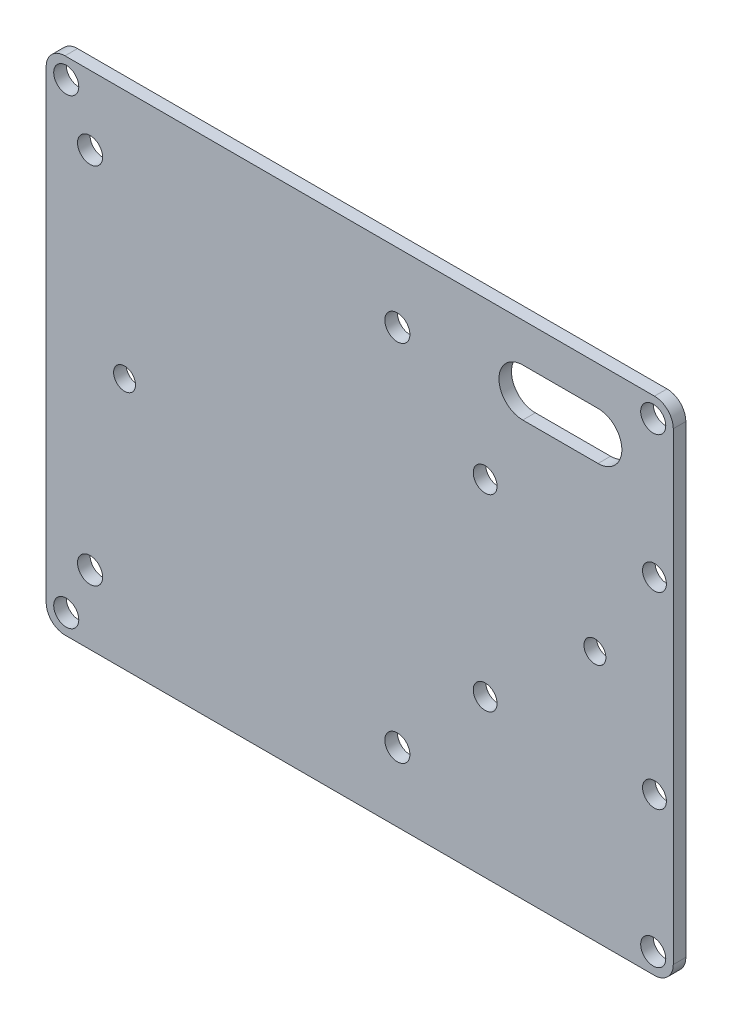
ISO-10303-21;
HEADER;
FILE_DESCRIPTION(('STEP AP214'),'2;1');
FILE_NAME('part.step','',(''),(''),'','','');
FILE_SCHEMA(('AUTOMOTIVE_DESIGN { 1 0 10303 214 1 1 1 1 }'));
ENDSEC;
DATA;
#1=APPLICATION_CONTEXT('core data for automotive mechanical design processes');
#2=APPLICATION_PROTOCOL_DEFINITION('international standard','automotive_design',2000,#1);
#3=PRODUCT_CONTEXT('',#1,'mechanical');
#4=PRODUCT('Part','Part','',(#3));
#5=PRODUCT_RELATED_PRODUCT_CATEGORY('part','',(#4));
#6=PRODUCT_DEFINITION_FORMATION('','',#4);
#7=PRODUCT_DEFINITION_CONTEXT('part definition',#1,'design');
#8=PRODUCT_DEFINITION('design','',#6,#7);
#9=PRODUCT_DEFINITION_SHAPE('','',#8);
#10=(LENGTH_UNIT() NAMED_UNIT(*) SI_UNIT(.MILLI.,.METRE.));
#11=(NAMED_UNIT(*) PLANE_ANGLE_UNIT() SI_UNIT($,.RADIAN.));
#12=(NAMED_UNIT(*) SI_UNIT($,.STERADIAN.) SOLID_ANGLE_UNIT());
#13=UNCERTAINTY_MEASURE_WITH_UNIT(LENGTH_MEASURE(1.E-05),#10,'distance_accuracy_value','');
#14=(GEOMETRIC_REPRESENTATION_CONTEXT(3) GLOBAL_UNCERTAINTY_ASSIGNED_CONTEXT((#13)) GLOBAL_UNIT_ASSIGNED_CONTEXT((#10,
#11,#12)) REPRESENTATION_CONTEXT('',''));
#15=CARTESIAN_POINT('',(0.,0.,0.));
#16=DIRECTION('',(0.,0.,1.));
#17=DIRECTION('',(1.,0.,0.));
#18=AXIS2_PLACEMENT_3D('',#15,#16,#17);
#19=CARTESIAN_POINT('',(-47.,-37.,2.));
#20=DIRECTION('',(0.,0.,-1.));
#21=DIRECTION('',(-1.,0.,0.));
#22=AXIS2_PLACEMENT_3D('',#19,#20,#21);
#23=CYLINDRICAL_SURFACE('',#22,3.);
#24=CARTESIAN_POINT('',(-47.,-37.,0.));
#25=DIRECTION('',(0.,0.,1.));
#26=DIRECTION('',(1.,0.,0.));
#27=AXIS2_PLACEMENT_3D('',#24,#25,#26);
#28=CIRCLE('',#27,3.);
#29=CARTESIAN_POINT('',(-50.,-37.,0.));
#30=VERTEX_POINT('',#29);
#31=CARTESIAN_POINT('',(-46.9999999999999,-40.,0.));
#32=VERTEX_POINT('',#31);
#33=EDGE_CURVE('E237',#30,#32,#28,.T.);
#34=ORIENTED_EDGE('',*,*,#33,.T.);
#35=DIRECTION('',(0.,0.,-1.));
#36=VECTOR('',#35,1.);
#37=CARTESIAN_POINT('',(-46.9999999999999,-40.,2.));
#38=LINE('',#37,#36);
#39=CARTESIAN_POINT('',(-46.9999999999999,-40.,2.));
#40=VERTEX_POINT('',#39);
#41=EDGE_CURVE('E11',#40,#32,#38,.T.);
#42=ORIENTED_EDGE('',*,*,#41,.F.);
#43=CARTESIAN_POINT('',(-47.,-37.,2.));
#44=DIRECTION('',(0.,0.,1.));
#45=DIRECTION('',(1.,0.,0.));
#46=AXIS2_PLACEMENT_3D('',#43,#44,#45);
#47=CIRCLE('',#46,3.);
#48=CARTESIAN_POINT('',(-50.,-37.,2.));
#49=VERTEX_POINT('',#48);
#50=EDGE_CURVE('E240',#49,#40,#47,.T.);
#51=ORIENTED_EDGE('',*,*,#50,.F.);
#52=DIRECTION('',(0.,0.,-1.));
#53=VECTOR('',#52,1.);
#54=CARTESIAN_POINT('',(-50.,-37.,2.));
#55=LINE('',#54,#53);
#56=EDGE_CURVE('E258',#49,#30,#55,.T.);
#57=ORIENTED_EDGE('',*,*,#56,.T.);
#58=EDGE_LOOP('',(#34,#42,#51,#57));
#59=FACE_BOUND('',#58,.T.);
#60=ADVANCED_FACE('F39',(#59),#23,.T.);
#61=CARTESIAN_POINT('',(-46.9999999999999,-40.,2.));
#62=DIRECTION('',(0.,1.,0.));
#63=DIRECTION('',(0.,0.,1.));
#64=AXIS2_PLACEMENT_3D('',#61,#62,#63);
#65=PLANE('',#64);
#66=DIRECTION('',(1.,0.,0.));
#67=VECTOR('',#66,1.);
#68=CARTESIAN_POINT('',(-46.9999999999999,-40.,0.));
#69=LINE('',#68,#67);
#70=CARTESIAN_POINT('',(47.,-40.,0.));
#71=VERTEX_POINT('',#70);
#72=EDGE_CURVE('E261',#32,#71,#69,.T.);
#73=ORIENTED_EDGE('',*,*,#72,.T.);
#74=DIRECTION('',(0.,0.,-1.));
#75=VECTOR('',#74,1.);
#76=CARTESIAN_POINT('',(47.,-40.,2.));
#77=LINE('',#76,#75);
#78=CARTESIAN_POINT('',(47.,-40.,2.));
#79=VERTEX_POINT('',#78);
#80=EDGE_CURVE('E46',#79,#71,#77,.T.);
#81=ORIENTED_EDGE('',*,*,#80,.F.);
#82=DIRECTION('',(1.,0.,0.));
#83=VECTOR('',#82,1.);
#84=CARTESIAN_POINT('',(-46.9999999999999,-40.,2.));
#85=LINE('',#84,#83);
#86=EDGE_CURVE('E243',#40,#79,#85,.T.);
#87=ORIENTED_EDGE('',*,*,#86,.F.);
#88=ORIENTED_EDGE('',*,*,#41,.T.);
#89=EDGE_LOOP('',(#73,#81,#87,#88));
#90=FACE_BOUND('',#89,.T.);
#91=ADVANCED_FACE('F317',(#90),#65,.F.);
#92=CARTESIAN_POINT('',(47.,-37.,2.));
#93=DIRECTION('',(0.,0.,-1.));
#94=DIRECTION('',(-1.,0.,0.));
#95=AXIS2_PLACEMENT_3D('',#92,#93,#94);
#96=CYLINDRICAL_SURFACE('',#95,3.);
#97=CARTESIAN_POINT('',(47.,-37.,0.));
#98=DIRECTION('',(0.,0.,1.));
#99=DIRECTION('',(1.,0.,0.));
#100=AXIS2_PLACEMENT_3D('',#97,#98,#99);
#101=CIRCLE('',#100,3.);
#102=CARTESIAN_POINT('',(50.,-37.,0.));
#103=VERTEX_POINT('',#102);
#104=EDGE_CURVE('E263',#71,#103,#101,.T.);
#105=ORIENTED_EDGE('',*,*,#104,.T.);
#106=DIRECTION('',(0.,0.,-1.));
#107=VECTOR('',#106,1.);
#108=CARTESIAN_POINT('',(50.,-37.,2.));
#109=LINE('',#108,#107);
#110=CARTESIAN_POINT('',(50.,-37.,2.));
#111=VERTEX_POINT('',#110);
#112=EDGE_CURVE('E288',#111,#103,#109,.T.);
#113=ORIENTED_EDGE('',*,*,#112,.F.);
#114=CARTESIAN_POINT('',(47.,-37.,2.));
#115=DIRECTION('',(0.,0.,1.));
#116=DIRECTION('',(1.,0.,0.));
#117=AXIS2_PLACEMENT_3D('',#114,#115,#116);
#118=CIRCLE('',#117,3.);
#119=EDGE_CURVE('E246',#79,#111,#118,.T.);
#120=ORIENTED_EDGE('',*,*,#119,.F.);
#121=ORIENTED_EDGE('',*,*,#80,.T.);
#122=EDGE_LOOP('',(#105,#113,#120,#121));
#123=FACE_BOUND('',#122,.T.);
#124=ADVANCED_FACE('F295',(#123),#96,.T.);
#125=CARTESIAN_POINT('',(50.,37.,2.));
#126=DIRECTION('',(-1.,0.,0.));
#127=DIRECTION('',(0.,-1.,0.));
#128=AXIS2_PLACEMENT_3D('',#125,#126,#127);
#129=PLANE('',#128);
#130=DIRECTION('',(0.,1.,0.));
#131=VECTOR('',#130,1.);
#132=CARTESIAN_POINT('',(50.,37.,0.));
#133=LINE('',#132,#131);
#134=CARTESIAN_POINT('',(50.,37.,0.));
#135=VERTEX_POINT('',#134);
#136=EDGE_CURVE('E265',#103,#135,#133,.T.);
#137=ORIENTED_EDGE('',*,*,#136,.T.);
#138=DIRECTION('',(0.,0.,-1.));
#139=VECTOR('',#138,1.);
#140=CARTESIAN_POINT('',(50.,37.,2.));
#141=LINE('',#140,#139);
#142=CARTESIAN_POINT('',(50.,37.,2.));
#143=VERTEX_POINT('',#142);
#144=EDGE_CURVE('E285',#143,#135,#141,.T.);
#145=ORIENTED_EDGE('',*,*,#144,.F.);
#146=DIRECTION('',(0.,1.,0.));
#147=VECTOR('',#146,1.);
#148=CARTESIAN_POINT('',(50.,37.,2.));
#149=LINE('',#148,#147);
#150=EDGE_CURVE('E248',#111,#143,#149,.T.);
#151=ORIENTED_EDGE('',*,*,#150,.F.);
#152=ORIENTED_EDGE('',*,*,#112,.T.);
#153=EDGE_LOOP('',(#137,#145,#151,#152));
#154=FACE_BOUND('',#153,.T.);
#155=ADVANCED_FACE('F305',(#154),#129,.F.);
#156=CARTESIAN_POINT('',(47.,37.,2.));
#157=DIRECTION('',(0.,0.,-1.));
#158=DIRECTION('',(-1.,0.,0.));
#159=AXIS2_PLACEMENT_3D('',#156,#157,#158);
#160=CYLINDRICAL_SURFACE('',#159,3.);
#161=CARTESIAN_POINT('',(47.,37.,0.));
#162=DIRECTION('',(0.,0.,1.));
#163=DIRECTION('',(-1.,0.,0.));
#164=AXIS2_PLACEMENT_3D('',#161,#162,#163);
#165=CIRCLE('',#164,3.);
#166=CARTESIAN_POINT('',(47.,40.,0.));
#167=VERTEX_POINT('',#166);
#168=EDGE_CURVE('E267',#135,#167,#165,.T.);
#169=ORIENTED_EDGE('',*,*,#168,.T.);
#170=DIRECTION('',(0.,0.,-1.));
#171=VECTOR('',#170,1.);
#172=CARTESIAN_POINT('',(47.,40.,2.));
#173=LINE('',#172,#171);
#174=CARTESIAN_POINT('',(47.,40.,2.));
#175=VERTEX_POINT('',#174);
#176=EDGE_CURVE('E282',#175,#167,#173,.T.);
#177=ORIENTED_EDGE('',*,*,#176,.F.);
#178=CARTESIAN_POINT('',(47.,37.,2.));
#179=DIRECTION('',(0.,0.,1.));
#180=DIRECTION('',(-1.,0.,0.));
#181=AXIS2_PLACEMENT_3D('',#178,#179,#180);
#182=CIRCLE('',#181,3.);
#183=EDGE_CURVE('E250',#143,#175,#182,.T.);
#184=ORIENTED_EDGE('',*,*,#183,.F.);
#185=ORIENTED_EDGE('',*,*,#144,.T.);
#186=EDGE_LOOP('',(#169,#177,#184,#185));
#187=FACE_BOUND('',#186,.T.);
#188=ADVANCED_FACE('F309',(#187),#160,.T.);
#189=CARTESIAN_POINT('',(-47.,40.,2.));
#190=DIRECTION('',(0.,-1.,0.));
#191=DIRECTION('',(0.,0.,-1.));
#192=AXIS2_PLACEMENT_3D('',#189,#190,#191);
#193=PLANE('',#192);
#194=DIRECTION('',(-1.,0.,0.));
#195=VECTOR('',#194,1.);
#196=CARTESIAN_POINT('',(-47.,40.,0.));
#197=LINE('',#196,#195);
#198=CARTESIAN_POINT('',(-47.,40.,0.));
#199=VERTEX_POINT('',#198);
#200=EDGE_CURVE('E269',#167,#199,#197,.T.);
#201=ORIENTED_EDGE('',*,*,#200,.T.);
#202=DIRECTION('',(0.,0.,-1.));
#203=VECTOR('',#202,1.);
#204=CARTESIAN_POINT('',(-47.,40.,2.));
#205=LINE('',#204,#203);
#206=CARTESIAN_POINT('',(-47.,40.,2.));
#207=VERTEX_POINT('',#206);
#208=EDGE_CURVE('E279',#207,#199,#205,.T.);
#209=ORIENTED_EDGE('',*,*,#208,.F.);
#210=DIRECTION('',(-1.,0.,0.));
#211=VECTOR('',#210,1.);
#212=CARTESIAN_POINT('',(-47.,40.,2.));
#213=LINE('',#212,#211);
#214=EDGE_CURVE('E252',#175,#207,#213,.T.);
#215=ORIENTED_EDGE('',*,*,#214,.F.);
#216=ORIENTED_EDGE('',*,*,#176,.T.);
#217=EDGE_LOOP('',(#201,#209,#215,#216));
#218=FACE_BOUND('',#217,.T.);
#219=ADVANCED_FACE('F330',(#218),#193,.F.);
#220=CARTESIAN_POINT('',(-47.,37.,2.));
#221=DIRECTION('',(0.,0.,-1.));
#222=DIRECTION('',(-1.,0.,0.));
#223=AXIS2_PLACEMENT_3D('',#220,#221,#222);
#224=CYLINDRICAL_SURFACE('',#223,3.);
#225=CARTESIAN_POINT('',(-47.,37.,0.));
#226=DIRECTION('',(0.,0.,1.));
#227=DIRECTION('',(1.,0.,0.));
#228=AXIS2_PLACEMENT_3D('',#225,#226,#227);
#229=CIRCLE('',#228,3.);
#230=CARTESIAN_POINT('',(-50.,37.,0.));
#231=VERTEX_POINT('',#230);
#232=EDGE_CURVE('E271',#199,#231,#229,.T.);
#233=ORIENTED_EDGE('',*,*,#232,.T.);
#234=DIRECTION('',(0.,0.,-1.));
#235=VECTOR('',#234,1.);
#236=CARTESIAN_POINT('',(-50.,37.,2.));
#237=LINE('',#236,#235);
#238=CARTESIAN_POINT('',(-50.,37.,2.));
#239=VERTEX_POINT('',#238);
#240=EDGE_CURVE('E276',#239,#231,#237,.T.);
#241=ORIENTED_EDGE('',*,*,#240,.F.);
#242=CARTESIAN_POINT('',(-47.,37.,2.));
#243=DIRECTION('',(0.,0.,1.));
#244=DIRECTION('',(1.,0.,0.));
#245=AXIS2_PLACEMENT_3D('',#242,#243,#244);
#246=CIRCLE('',#245,3.);
#247=EDGE_CURVE('E254',#207,#239,#246,.T.);
#248=ORIENTED_EDGE('',*,*,#247,.F.);
#249=ORIENTED_EDGE('',*,*,#208,.T.);
#250=EDGE_LOOP('',(#233,#241,#248,#249));
#251=FACE_BOUND('',#250,.T.);
#252=ADVANCED_FACE('F328',(#251),#224,.T.);
#253=CARTESIAN_POINT('',(-50.,37.,2.));
#254=DIRECTION('',(1.,0.,0.));
#255=DIRECTION('',(0.,1.,0.));
#256=AXIS2_PLACEMENT_3D('',#253,#254,#255);
#257=PLANE('',#256);
#258=DIRECTION('',(0.,-1.,0.));
#259=VECTOR('',#258,1.);
#260=CARTESIAN_POINT('',(-50.,37.,0.));
#261=LINE('',#260,#259);
#262=EDGE_CURVE('E244',#231,#30,#261,.T.);
#263=ORIENTED_EDGE('',*,*,#262,.T.);
#264=ORIENTED_EDGE('',*,*,#56,.F.);
#265=DIRECTION('',(0.,-1.,0.));
#266=VECTOR('',#265,1.);
#267=CARTESIAN_POINT('',(-50.,37.,2.));
#268=LINE('',#267,#266);
#269=EDGE_CURVE('E256',#239,#49,#268,.T.);
#270=ORIENTED_EDGE('',*,*,#269,.F.);
#271=ORIENTED_EDGE('',*,*,#240,.T.);
#272=EDGE_LOOP('',(#263,#264,#270,#271));
#273=FACE_BOUND('',#272,.T.);
#274=ADVANCED_FACE('F323',(#273),#257,.F.);
#275=CARTESIAN_POINT('',(-47.,-37.,2.));
#276=DIRECTION('',(0.,0.,1.));
#277=DIRECTION('',(1.,0.,0.));
#278=AXIS2_PLACEMENT_3D('',#275,#276,#277);
#279=PLANE('',#278);
#280=CARTESIAN_POINT('',(-37.5,0.169558905800005,2.));
#281=DIRECTION('',(0.,0.,1.));
#282=DIRECTION('',(1.,0.,0.));
#283=AXIS2_PLACEMENT_3D('',#280,#281,#282);
#284=CIRCLE('',#283,1.75);
#285=CARTESIAN_POINT('',(-35.75,0.169558905800005,2.));
#286=VERTEX_POINT('',#285);
#287=EDGE_CURVE('E647',#286,#286,#284,.T.);
#288=ORIENTED_EDGE('',*,*,#287,.F.);
#289=EDGE_LOOP('',(#288));
#290=FACE_BOUND('',#289,.T.);
#291=CARTESIAN_POINT('',(37.5,0.,2.));
#292=DIRECTION('',(0.,0.,1.));
#293=DIRECTION('',(1.,0.,0.));
#294=AXIS2_PLACEMENT_3D('',#291,#292,#293);
#295=CIRCLE('',#294,1.75);
#296=CARTESIAN_POINT('',(39.25,0.,2.));
#297=VERTEX_POINT('',#296);
#298=EDGE_CURVE('E648',#297,#297,#295,.T.);
#299=ORIENTED_EDGE('',*,*,#298,.F.);
#300=EDGE_LOOP('',(#299));
#301=FACE_BOUND('',#300,.T.);
#302=CARTESIAN_POINT('',(26.,30.,2.));
#303=DIRECTION('',(0.,0.,1.));
#304=DIRECTION('',(1.,0.,0.));
#305=AXIS2_PLACEMENT_3D('',#302,#303,#304);
#306=CIRCLE('',#305,3.8);
#307=CARTESIAN_POINT('',(26.,33.8,2.));
#308=VERTEX_POINT('',#307);
#309=CARTESIAN_POINT('',(26.,26.2,2.));
#310=VERTEX_POINT('',#309);
#311=EDGE_CURVE('E53',#308,#310,#306,.T.);
#312=ORIENTED_EDGE('',*,*,#311,.F.);
#313=DIRECTION('',(-1.,0.,0.));
#314=VECTOR('',#313,1.);
#315=CARTESIAN_POINT('',(26.,33.8,2.));
#316=LINE('',#315,#314);
#317=CARTESIAN_POINT('',(38.,33.8,2.));
#318=VERTEX_POINT('',#317);
#319=EDGE_CURVE('E145',#318,#308,#316,.T.);
#320=ORIENTED_EDGE('',*,*,#319,.F.);
#321=CARTESIAN_POINT('',(38.,30.,2.));
#322=DIRECTION('',(0.,0.,1.));
#323=DIRECTION('',(1.,0.,0.));
#324=AXIS2_PLACEMENT_3D('',#321,#322,#323);
#325=CIRCLE('',#324,3.8);
#326=CARTESIAN_POINT('',(38.,26.2,2.));
#327=VERTEX_POINT('',#326);
#328=EDGE_CURVE('E148',#327,#318,#325,.T.);
#329=ORIENTED_EDGE('',*,*,#328,.F.);
#330=DIRECTION('',(1.,0.,0.));
#331=VECTOR('',#330,1.);
#332=CARTESIAN_POINT('',(26.,26.2,2.));
#333=LINE('',#332,#331);
#334=EDGE_CURVE('E157',#310,#327,#333,.T.);
#335=ORIENTED_EDGE('',*,*,#334,.F.);
#336=EDGE_LOOP('',(#312,#320,#329,#335));
#337=FACE_BOUND('',#336,.T.);
#338=CARTESIAN_POINT('',(6.00000000000003,29.,2.));
#339=DIRECTION('',(0.,0.,1.));
#340=DIRECTION('',(1.,0.,0.));
#341=AXIS2_PLACEMENT_3D('',#338,#339,#340);
#342=CIRCLE('',#341,2.);
#343=CARTESIAN_POINT('',(8.00000000000003,29.,2.));
#344=VERTEX_POINT('',#343);
#345=EDGE_CURVE('E198',#344,#344,#342,.T.);
#346=ORIENTED_EDGE('',*,*,#345,.F.);
#347=EDGE_LOOP('',(#346));
#348=FACE_BOUND('',#347,.T.);
#349=CARTESIAN_POINT('',(6.00000000000003,-29.,2.));
#350=DIRECTION('',(0.,0.,1.));
#351=DIRECTION('',(1.,0.,0.));
#352=AXIS2_PLACEMENT_3D('',#349,#350,#351);
#353=CIRCLE('',#352,2.);
#354=CARTESIAN_POINT('',(8.00000000000003,-29.,2.));
#355=VERTEX_POINT('',#354);
#356=EDGE_CURVE('E205',#355,#355,#353,.T.);
#357=ORIENTED_EDGE('',*,*,#356,.F.);
#358=EDGE_LOOP('',(#357));
#359=FACE_BOUND('',#358,.T.);
#360=CARTESIAN_POINT('',(-43.,-29.,2.));
#361=DIRECTION('',(0.,0.,1.));
#362=DIRECTION('',(1.,0.,0.));
#363=AXIS2_PLACEMENT_3D('',#360,#361,#362);
#364=CIRCLE('',#363,2.);
#365=CARTESIAN_POINT('',(-41.,-29.,2.));
#366=VERTEX_POINT('',#365);
#367=EDGE_CURVE('E186',#366,#366,#364,.T.);
#368=ORIENTED_EDGE('',*,*,#367,.F.);
#369=EDGE_LOOP('',(#368));
#370=FACE_BOUND('',#369,.T.);
#371=CARTESIAN_POINT('',(47.,-15.,2.));
#372=DIRECTION('',(0.,0.,1.));
#373=DIRECTION('',(1.,0.,0.));
#374=AXIS2_PLACEMENT_3D('',#371,#372,#373);
#375=CIRCLE('',#374,1.9);
#376=CARTESIAN_POINT('',(48.9,-15.,2.));
#377=VERTEX_POINT('',#376);
#378=EDGE_CURVE('E193',#377,#377,#375,.T.);
#379=ORIENTED_EDGE('',*,*,#378,.F.);
#380=EDGE_LOOP('',(#379));
#381=FACE_BOUND('',#380,.T.);
#382=CARTESIAN_POINT('',(-43.,29.,2.));
#383=DIRECTION('',(0.,0.,1.));
#384=DIRECTION('',(1.,0.,0.));
#385=AXIS2_PLACEMENT_3D('',#382,#383,#384);
#386=CIRCLE('',#385,2.);
#387=CARTESIAN_POINT('',(-41.,29.,2.));
#388=VERTEX_POINT('',#387);
#389=EDGE_CURVE('E229',#388,#388,#386,.T.);
#390=ORIENTED_EDGE('',*,*,#389,.F.);
#391=EDGE_LOOP('',(#390));
#392=FACE_BOUND('',#391,.T.);
#393=CARTESIAN_POINT('',(-46.8,-36.8,2.));
#394=DIRECTION('',(0.,0.,1.));
#395=DIRECTION('',(1.,0.,0.));
#396=AXIS2_PLACEMENT_3D('',#393,#394,#395);
#397=CIRCLE('',#396,2.);
#398=CARTESIAN_POINT('',(-44.8,-36.8,2.));
#399=VERTEX_POINT('',#398);
#400=EDGE_CURVE('E223',#399,#399,#397,.T.);
#401=ORIENTED_EDGE('',*,*,#400,.F.);
#402=EDGE_LOOP('',(#401));
#403=FACE_BOUND('',#402,.T.);
#404=CARTESIAN_POINT('',(46.8,-36.8,2.));
#405=DIRECTION('',(0.,0.,1.));
#406=DIRECTION('',(1.,0.,0.));
#407=AXIS2_PLACEMENT_3D('',#404,#405,#406);
#408=CIRCLE('',#407,2.);
#409=CARTESIAN_POINT('',(48.8,-36.8,2.));
#410=VERTEX_POINT('',#409);
#411=EDGE_CURVE('E217',#410,#410,#408,.T.);
#412=ORIENTED_EDGE('',*,*,#411,.F.);
#413=EDGE_LOOP('',(#412));
#414=FACE_BOUND('',#413,.T.);
#415=CARTESIAN_POINT('',(46.8,36.8,2.));
#416=DIRECTION('',(0.,0.,1.));
#417=DIRECTION('',(1.,0.,0.));
#418=AXIS2_PLACEMENT_3D('',#415,#416,#417);
#419=CIRCLE('',#418,2.);
#420=CARTESIAN_POINT('',(48.8,36.8,2.));
#421=VERTEX_POINT('',#420);
#422=EDGE_CURVE('E210',#421,#421,#419,.T.);
#423=ORIENTED_EDGE('',*,*,#422,.F.);
#424=EDGE_LOOP('',(#423));
#425=FACE_BOUND('',#424,.T.);
#426=CARTESIAN_POINT('',(47.,15.,2.));
#427=DIRECTION('',(0.,0.,1.));
#428=DIRECTION('',(1.,0.,0.));
#429=AXIS2_PLACEMENT_3D('',#426,#427,#428);
#430=CIRCLE('',#429,1.9);
#431=CARTESIAN_POINT('',(48.9,15.,2.));
#432=VERTEX_POINT('',#431);
#433=EDGE_CURVE('E168',#432,#432,#430,.T.);
#434=ORIENTED_EDGE('',*,*,#433,.F.);
#435=EDGE_LOOP('',(#434));
#436=FACE_BOUND('',#435,.T.);
#437=CARTESIAN_POINT('',(20.,15.,2.));
#438=DIRECTION('',(0.,0.,1.));
#439=DIRECTION('',(1.,0.,0.));
#440=AXIS2_PLACEMENT_3D('',#437,#438,#439);
#441=CIRCLE('',#440,1.9);
#442=CARTESIAN_POINT('',(21.9,15.,2.));
#443=VERTEX_POINT('',#442);
#444=EDGE_CURVE('E175',#443,#443,#441,.T.);
#445=ORIENTED_EDGE('',*,*,#444,.F.);
#446=EDGE_LOOP('',(#445));
#447=FACE_BOUND('',#446,.T.);
#448=CARTESIAN_POINT('',(20.,-15.,2.));
#449=DIRECTION('',(0.,0.,1.));
#450=DIRECTION('',(1.,0.,0.));
#451=AXIS2_PLACEMENT_3D('',#448,#449,#450);
#452=CIRCLE('',#451,1.9);
#453=CARTESIAN_POINT('',(21.9,-15.,2.));
#454=VERTEX_POINT('',#453);
#455=EDGE_CURVE('E181',#454,#454,#452,.T.);
#456=ORIENTED_EDGE('',*,*,#455,.F.);
#457=EDGE_LOOP('',(#456));
#458=FACE_BOUND('',#457,.T.);
#459=CARTESIAN_POINT('',(-46.8,36.8,2.));
#460=DIRECTION('',(0.,0.,1.));
#461=DIRECTION('',(1.,0.,0.));
#462=AXIS2_PLACEMENT_3D('',#459,#460,#461);
#463=CIRCLE('',#462,2.);
#464=CARTESIAN_POINT('',(-44.8,36.8,2.));
#465=VERTEX_POINT('',#464);
#466=EDGE_CURVE('E213',#465,#465,#463,.T.);
#467=ORIENTED_EDGE('',*,*,#466,.F.);
#468=EDGE_LOOP('',(#467));
#469=FACE_BOUND('',#468,.T.);
#470=ORIENTED_EDGE('',*,*,#50,.T.);
#471=ORIENTED_EDGE('',*,*,#86,.T.);
#472=ORIENTED_EDGE('',*,*,#119,.T.);
#473=ORIENTED_EDGE('',*,*,#150,.T.);
#474=ORIENTED_EDGE('',*,*,#183,.T.);
#475=ORIENTED_EDGE('',*,*,#214,.T.);
#476=ORIENTED_EDGE('',*,*,#247,.T.);
#477=ORIENTED_EDGE('',*,*,#269,.T.);
#478=EDGE_LOOP('',(#470,#471,#472,#473,#474,#475,#476,#477));
#479=FACE_BOUND('',#478,.T.);
#480=ADVANCED_FACE('F313',(#290,#301,#337,#348,#359,#370,#381,#392,#403,#414,#425,#436,#447,
#458,#469,#479),#279,.T.);
#481=CARTESIAN_POINT('',(-47.,-37.,0.));
#482=DIRECTION('',(0.,0.,1.));
#483=DIRECTION('',(1.,0.,0.));
#484=AXIS2_PLACEMENT_3D('',#481,#482,#483);
#485=PLANE('',#484);
#486=CARTESIAN_POINT('',(-37.5,0.169558905800005,0.));
#487=DIRECTION('',(0.,0.,1.));
#488=DIRECTION('',(1.,0.,0.));
#489=AXIS2_PLACEMENT_3D('',#486,#487,#488);
#490=CIRCLE('',#489,1.75);
#491=CARTESIAN_POINT('',(-35.75,0.169558905800005,0.));
#492=VERTEX_POINT('',#491);
#493=EDGE_CURVE('E158',#492,#492,#490,.T.);
#494=ORIENTED_EDGE('',*,*,#493,.T.);
#495=EDGE_LOOP('',(#494));
#496=FACE_BOUND('',#495,.T.);
#497=CARTESIAN_POINT('',(37.5,0.,0.));
#498=DIRECTION('',(0.,0.,1.));
#499=DIRECTION('',(1.,0.,0.));
#500=AXIS2_PLACEMENT_3D('',#497,#498,#499);
#501=CIRCLE('',#500,1.75);
#502=CARTESIAN_POINT('',(39.25,0.,0.));
#503=VERTEX_POINT('',#502);
#504=EDGE_CURVE('E151',#503,#503,#501,.T.);
#505=ORIENTED_EDGE('',*,*,#504,.T.);
#506=EDGE_LOOP('',(#505));
#507=FACE_BOUND('',#506,.T.);
#508=DIRECTION('',(-1.,0.,0.));
#509=VECTOR('',#508,1.);
#510=CARTESIAN_POINT('',(26.,33.8,0.));
#511=LINE('',#510,#509);
#512=CARTESIAN_POINT('',(38.,33.8,0.));
#513=VERTEX_POINT('',#512);
#514=CARTESIAN_POINT('',(26.,33.8,0.));
#515=VERTEX_POINT('',#514);
#516=EDGE_CURVE('E135',#513,#515,#511,.T.);
#517=ORIENTED_EDGE('',*,*,#516,.T.);
#518=CARTESIAN_POINT('',(26.,30.,0.));
#519=DIRECTION('',(0.,0.,1.));
#520=DIRECTION('',(1.,0.,0.));
#521=AXIS2_PLACEMENT_3D('',#518,#519,#520);
#522=CIRCLE('',#521,3.8);
#523=CARTESIAN_POINT('',(26.,26.2,0.));
#524=VERTEX_POINT('',#523);
#525=EDGE_CURVE('E129',#515,#524,#522,.T.);
#526=ORIENTED_EDGE('',*,*,#525,.T.);
#527=DIRECTION('',(1.,0.,0.));
#528=VECTOR('',#527,1.);
#529=CARTESIAN_POINT('',(26.,26.2,0.));
#530=LINE('',#529,#528);
#531=CARTESIAN_POINT('',(38.,26.2,0.));
#532=VERTEX_POINT('',#531);
#533=EDGE_CURVE('E138',#524,#532,#530,.T.);
#534=ORIENTED_EDGE('',*,*,#533,.T.);
#535=CARTESIAN_POINT('',(38.,30.,0.));
#536=DIRECTION('',(0.,0.,1.));
#537=DIRECTION('',(1.,0.,0.));
#538=AXIS2_PLACEMENT_3D('',#535,#536,#537);
#539=CIRCLE('',#538,3.8);
#540=EDGE_CURVE('E61',#532,#513,#539,.T.);
#541=ORIENTED_EDGE('',*,*,#540,.T.);
#542=EDGE_LOOP('',(#517,#526,#534,#541));
#543=FACE_BOUND('',#542,.T.);
#544=CARTESIAN_POINT('',(6.00000000000003,29.,0.));
#545=DIRECTION('',(0.,0.,1.));
#546=DIRECTION('',(1.,0.,0.));
#547=AXIS2_PLACEMENT_3D('',#544,#545,#546);
#548=CIRCLE('',#547,2.);
#549=CARTESIAN_POINT('',(8.00000000000003,29.,0.));
#550=VERTEX_POINT('',#549);
#551=EDGE_CURVE('E202',#550,#550,#548,.T.);
#552=ORIENTED_EDGE('',*,*,#551,.T.);
#553=EDGE_LOOP('',(#552));
#554=FACE_BOUND('',#553,.T.);
#555=CARTESIAN_POINT('',(6.00000000000003,-29.,0.));
#556=DIRECTION('',(0.,0.,1.));
#557=DIRECTION('',(1.,0.,0.));
#558=AXIS2_PLACEMENT_3D('',#555,#556,#557);
#559=CIRCLE('',#558,2.);
#560=CARTESIAN_POINT('',(8.00000000000003,-29.,0.));
#561=VERTEX_POINT('',#560);
#562=EDGE_CURVE('E189',#561,#561,#559,.T.);
#563=ORIENTED_EDGE('',*,*,#562,.T.);
#564=EDGE_LOOP('',(#563));
#565=FACE_BOUND('',#564,.T.);
#566=CARTESIAN_POINT('',(-43.,-29.,0.));
#567=DIRECTION('',(0.,0.,1.));
#568=DIRECTION('',(1.,0.,0.));
#569=AXIS2_PLACEMENT_3D('',#566,#567,#568);
#570=CIRCLE('',#569,2.);
#571=CARTESIAN_POINT('',(-41.,-29.,0.));
#572=VERTEX_POINT('',#571);
#573=EDGE_CURVE('E190',#572,#572,#570,.T.);
#574=ORIENTED_EDGE('',*,*,#573,.T.);
#575=EDGE_LOOP('',(#574));
#576=FACE_BOUND('',#575,.T.);
#577=CARTESIAN_POINT('',(47.,-15.,0.));
#578=DIRECTION('',(0.,0.,1.));
#579=DIRECTION('',(1.,0.,0.));
#580=AXIS2_PLACEMENT_3D('',#577,#578,#579);
#581=CIRCLE('',#580,1.9);
#582=CARTESIAN_POINT('',(48.9,-15.,0.));
#583=VERTEX_POINT('',#582);
#584=EDGE_CURVE('E171',#583,#583,#581,.T.);
#585=ORIENTED_EDGE('',*,*,#584,.T.);
#586=EDGE_LOOP('',(#585));
#587=FACE_BOUND('',#586,.T.);
#588=CARTESIAN_POINT('',(-43.,29.,0.));
#589=DIRECTION('',(0.,0.,1.));
#590=DIRECTION('',(1.,0.,0.));
#591=AXIS2_PLACEMENT_3D('',#588,#589,#590);
#592=CIRCLE('',#591,2.);
#593=CARTESIAN_POINT('',(-41.,29.,0.));
#594=VERTEX_POINT('',#593);
#595=EDGE_CURVE('E201',#594,#594,#592,.T.);
#596=ORIENTED_EDGE('',*,*,#595,.T.);
#597=EDGE_LOOP('',(#596));
#598=FACE_BOUND('',#597,.T.);
#599=CARTESIAN_POINT('',(-46.8,-36.8,0.));
#600=DIRECTION('',(0.,0.,1.));
#601=DIRECTION('',(1.,0.,0.));
#602=AXIS2_PLACEMENT_3D('',#599,#600,#601);
#603=CIRCLE('',#602,2.);
#604=CARTESIAN_POINT('',(-44.8,-36.8,0.));
#605=VERTEX_POINT('',#604);
#606=EDGE_CURVE('E226',#605,#605,#603,.T.);
#607=ORIENTED_EDGE('',*,*,#606,.T.);
#608=EDGE_LOOP('',(#607));
#609=FACE_BOUND('',#608,.T.);
#610=CARTESIAN_POINT('',(46.8,-36.8,0.));
#611=DIRECTION('',(0.,0.,1.));
#612=DIRECTION('',(1.,0.,0.));
#613=AXIS2_PLACEMENT_3D('',#610,#611,#612);
#614=CIRCLE('',#613,2.);
#615=CARTESIAN_POINT('',(48.8,-36.8,0.));
#616=VERTEX_POINT('',#615);
#617=EDGE_CURVE('E220',#616,#616,#614,.T.);
#618=ORIENTED_EDGE('',*,*,#617,.T.);
#619=EDGE_LOOP('',(#618));
#620=FACE_BOUND('',#619,.T.);
#621=CARTESIAN_POINT('',(46.8,36.8,0.));
#622=DIRECTION('',(0.,0.,1.));
#623=DIRECTION('',(1.,0.,0.));
#624=AXIS2_PLACEMENT_3D('',#621,#622,#623);
#625=CIRCLE('',#624,2.);
#626=CARTESIAN_POINT('',(48.8,36.8,0.));
#627=VERTEX_POINT('',#626);
#628=EDGE_CURVE('E214',#627,#627,#625,.T.);
#629=ORIENTED_EDGE('',*,*,#628,.T.);
#630=EDGE_LOOP('',(#629));
#631=FACE_BOUND('',#630,.T.);
#632=CARTESIAN_POINT('',(47.,15.,0.));
#633=DIRECTION('',(0.,0.,1.));
#634=DIRECTION('',(1.,0.,0.));
#635=AXIS2_PLACEMENT_3D('',#632,#633,#634);
#636=CIRCLE('',#635,1.9);
#637=CARTESIAN_POINT('',(48.9,15.,0.));
#638=VERTEX_POINT('',#637);
#639=EDGE_CURVE('E172',#638,#638,#636,.T.);
#640=ORIENTED_EDGE('',*,*,#639,.T.);
#641=EDGE_LOOP('',(#640));
#642=FACE_BOUND('',#641,.T.);
#643=CARTESIAN_POINT('',(20.,15.,0.));
#644=DIRECTION('',(0.,0.,1.));
#645=DIRECTION('',(1.,0.,0.));
#646=AXIS2_PLACEMENT_3D('',#643,#644,#645);
#647=CIRCLE('',#646,1.9);
#648=CARTESIAN_POINT('',(21.9,15.,0.));
#649=VERTEX_POINT('',#648);
#650=EDGE_CURVE('E178',#649,#649,#647,.T.);
#651=ORIENTED_EDGE('',*,*,#650,.T.);
#652=EDGE_LOOP('',(#651));
#653=FACE_BOUND('',#652,.T.);
#654=CARTESIAN_POINT('',(20.,-15.,0.));
#655=DIRECTION('',(0.,0.,1.));
#656=DIRECTION('',(1.,0.,0.));
#657=AXIS2_PLACEMENT_3D('',#654,#655,#656);
#658=CIRCLE('',#657,1.9);
#659=CARTESIAN_POINT('',(21.9,-15.,0.));
#660=VERTEX_POINT('',#659);
#661=EDGE_CURVE('E164',#660,#660,#658,.T.);
#662=ORIENTED_EDGE('',*,*,#661,.T.);
#663=EDGE_LOOP('',(#662));
#664=FACE_BOUND('',#663,.T.);
#665=CARTESIAN_POINT('',(-46.8,36.8,0.));
#666=DIRECTION('',(0.,0.,1.));
#667=DIRECTION('',(1.,0.,0.));
#668=AXIS2_PLACEMENT_3D('',#665,#666,#667);
#669=CIRCLE('',#668,2.);
#670=CARTESIAN_POINT('',(-44.8,36.8,0.));
#671=VERTEX_POINT('',#670);
#672=EDGE_CURVE('E234',#671,#671,#669,.T.);
#673=ORIENTED_EDGE('',*,*,#672,.T.);
#674=EDGE_LOOP('',(#673));
#675=FACE_BOUND('',#674,.T.);
#676=ORIENTED_EDGE('',*,*,#33,.F.);
#677=ORIENTED_EDGE('',*,*,#262,.F.);
#678=ORIENTED_EDGE('',*,*,#232,.F.);
#679=ORIENTED_EDGE('',*,*,#200,.F.);
#680=ORIENTED_EDGE('',*,*,#168,.F.);
#681=ORIENTED_EDGE('',*,*,#136,.F.);
#682=ORIENTED_EDGE('',*,*,#104,.F.);
#683=ORIENTED_EDGE('',*,*,#72,.F.);
#684=EDGE_LOOP('',(#676,#677,#678,#679,#680,#681,#682,#683));
#685=FACE_BOUND('',#684,.T.);
#686=ADVANCED_FACE('F142',(#496,#507,#543,#554,#565,#576,#587,#598,#609,#620,#631,#642,#653,
#664,#675,#685),#485,.F.);
#687=CARTESIAN_POINT('',(-46.8,36.8,0.));
#688=DIRECTION('',(0.,0.,1.));
#689=DIRECTION('',(1.,0.,0.));
#690=AXIS2_PLACEMENT_3D('',#687,#688,#689);
#691=CYLINDRICAL_SURFACE('',#690,2.);
#692=ORIENTED_EDGE('',*,*,#672,.F.);
#693=EDGE_LOOP('',(#692));
#694=FACE_BOUND('',#693,.T.);
#695=ORIENTED_EDGE('',*,*,#466,.T.);
#696=EDGE_LOOP('',(#695));
#697=FACE_BOUND('',#696,.T.);
#698=ADVANCED_FACE('F386',(#694,#697),#691,.F.);
#699=CARTESIAN_POINT('',(20.,-15.,0.));
#700=DIRECTION('',(0.,0.,1.));
#701=DIRECTION('',(1.,0.,0.));
#702=AXIS2_PLACEMENT_3D('',#699,#700,#701);
#703=CYLINDRICAL_SURFACE('',#702,1.9);
#704=ORIENTED_EDGE('',*,*,#661,.F.);
#705=EDGE_LOOP('',(#704));
#706=FACE_BOUND('',#705,.T.);
#707=ORIENTED_EDGE('',*,*,#455,.T.);
#708=EDGE_LOOP('',(#707));
#709=FACE_BOUND('',#708,.T.);
#710=ADVANCED_FACE('F391',(#706,#709),#703,.F.);
#711=CARTESIAN_POINT('',(20.,15.,0.));
#712=DIRECTION('',(0.,0.,1.));
#713=DIRECTION('',(1.,0.,0.));
#714=AXIS2_PLACEMENT_3D('',#711,#712,#713);
#715=CYLINDRICAL_SURFACE('',#714,1.9);
#716=ORIENTED_EDGE('',*,*,#650,.F.);
#717=EDGE_LOOP('',(#716));
#718=FACE_BOUND('',#717,.T.);
#719=ORIENTED_EDGE('',*,*,#444,.T.);
#720=EDGE_LOOP('',(#719));
#721=FACE_BOUND('',#720,.T.);
#722=ADVANCED_FACE('F404',(#718,#721),#715,.F.);
#723=CARTESIAN_POINT('',(47.,15.,0.));
#724=DIRECTION('',(0.,0.,1.));
#725=DIRECTION('',(1.,0.,0.));
#726=AXIS2_PLACEMENT_3D('',#723,#724,#725);
#727=CYLINDRICAL_SURFACE('',#726,1.9);
#728=ORIENTED_EDGE('',*,*,#639,.F.);
#729=EDGE_LOOP('',(#728));
#730=FACE_BOUND('',#729,.T.);
#731=ORIENTED_EDGE('',*,*,#433,.T.);
#732=EDGE_LOOP('',(#731));
#733=FACE_BOUND('',#732,.T.);
#734=ADVANCED_FACE('F415',(#730,#733),#727,.F.);
#735=CARTESIAN_POINT('',(46.8,36.8,0.));
#736=DIRECTION('',(0.,0.,1.));
#737=DIRECTION('',(1.,0.,0.));
#738=AXIS2_PLACEMENT_3D('',#735,#736,#737);
#739=CYLINDRICAL_SURFACE('',#738,2.);
#740=ORIENTED_EDGE('',*,*,#628,.F.);
#741=EDGE_LOOP('',(#740));
#742=FACE_BOUND('',#741,.T.);
#743=ORIENTED_EDGE('',*,*,#422,.T.);
#744=EDGE_LOOP('',(#743));
#745=FACE_BOUND('',#744,.T.);
#746=ADVANCED_FACE('F426',(#742,#745),#739,.F.);
#747=CARTESIAN_POINT('',(46.8,-36.8,0.));
#748=DIRECTION('',(0.,0.,1.));
#749=DIRECTION('',(1.,0.,0.));
#750=AXIS2_PLACEMENT_3D('',#747,#748,#749);
#751=CYLINDRICAL_SURFACE('',#750,2.);
#752=ORIENTED_EDGE('',*,*,#617,.F.);
#753=EDGE_LOOP('',(#752));
#754=FACE_BOUND('',#753,.T.);
#755=ORIENTED_EDGE('',*,*,#411,.T.);
#756=EDGE_LOOP('',(#755));
#757=FACE_BOUND('',#756,.T.);
#758=ADVANCED_FACE('F437',(#754,#757),#751,.F.);
#759=CARTESIAN_POINT('',(-46.8,-36.8,0.));
#760=DIRECTION('',(0.,0.,1.));
#761=DIRECTION('',(1.,0.,0.));
#762=AXIS2_PLACEMENT_3D('',#759,#760,#761);
#763=CYLINDRICAL_SURFACE('',#762,2.);
#764=ORIENTED_EDGE('',*,*,#606,.F.);
#765=EDGE_LOOP('',(#764));
#766=FACE_BOUND('',#765,.T.);
#767=ORIENTED_EDGE('',*,*,#400,.T.);
#768=EDGE_LOOP('',(#767));
#769=FACE_BOUND('',#768,.T.);
#770=ADVANCED_FACE('F448',(#766,#769),#763,.F.);
#771=CARTESIAN_POINT('',(-43.,29.,0.));
#772=DIRECTION('',(0.,0.,1.));
#773=DIRECTION('',(1.,0.,0.));
#774=AXIS2_PLACEMENT_3D('',#771,#772,#773);
#775=CYLINDRICAL_SURFACE('',#774,2.);
#776=ORIENTED_EDGE('',*,*,#595,.F.);
#777=EDGE_LOOP('',(#776));
#778=FACE_BOUND('',#777,.T.);
#779=ORIENTED_EDGE('',*,*,#389,.T.);
#780=EDGE_LOOP('',(#779));
#781=FACE_BOUND('',#780,.T.);
#782=ADVANCED_FACE('F459',(#778,#781),#775,.F.);
#783=CARTESIAN_POINT('',(47.,-15.,0.));
#784=DIRECTION('',(0.,0.,1.));
#785=DIRECTION('',(1.,0.,0.));
#786=AXIS2_PLACEMENT_3D('',#783,#784,#785);
#787=CYLINDRICAL_SURFACE('',#786,1.9);
#788=ORIENTED_EDGE('',*,*,#584,.F.);
#789=EDGE_LOOP('',(#788));
#790=FACE_BOUND('',#789,.T.);
#791=ORIENTED_EDGE('',*,*,#378,.T.);
#792=EDGE_LOOP('',(#791));
#793=FACE_BOUND('',#792,.T.);
#794=ADVANCED_FACE('F470',(#790,#793),#787,.F.);
#795=CARTESIAN_POINT('',(-43.,-29.,0.));
#796=DIRECTION('',(0.,0.,1.));
#797=DIRECTION('',(1.,0.,0.));
#798=AXIS2_PLACEMENT_3D('',#795,#796,#797);
#799=CYLINDRICAL_SURFACE('',#798,2.);
#800=ORIENTED_EDGE('',*,*,#573,.F.);
#801=EDGE_LOOP('',(#800));
#802=FACE_BOUND('',#801,.T.);
#803=ORIENTED_EDGE('',*,*,#367,.T.);
#804=EDGE_LOOP('',(#803));
#805=FACE_BOUND('',#804,.T.);
#806=ADVANCED_FACE('F481',(#802,#805),#799,.F.);
#807=CARTESIAN_POINT('',(6.00000000000003,-29.,0.));
#808=DIRECTION('',(0.,0.,1.));
#809=DIRECTION('',(1.,0.,0.));
#810=AXIS2_PLACEMENT_3D('',#807,#808,#809);
#811=CYLINDRICAL_SURFACE('',#810,2.);
#812=ORIENTED_EDGE('',*,*,#562,.F.);
#813=EDGE_LOOP('',(#812));
#814=FACE_BOUND('',#813,.T.);
#815=ORIENTED_EDGE('',*,*,#356,.T.);
#816=EDGE_LOOP('',(#815));
#817=FACE_BOUND('',#816,.T.);
#818=ADVANCED_FACE('F492',(#814,#817),#811,.F.);
#819=CARTESIAN_POINT('',(6.00000000000003,29.,0.));
#820=DIRECTION('',(0.,0.,1.));
#821=DIRECTION('',(1.,0.,0.));
#822=AXIS2_PLACEMENT_3D('',#819,#820,#821);
#823=CYLINDRICAL_SURFACE('',#822,2.);
#824=ORIENTED_EDGE('',*,*,#551,.F.);
#825=EDGE_LOOP('',(#824));
#826=FACE_BOUND('',#825,.T.);
#827=ORIENTED_EDGE('',*,*,#345,.T.);
#828=EDGE_LOOP('',(#827));
#829=FACE_BOUND('',#828,.T.);
#830=ADVANCED_FACE('F503',(#826,#829),#823,.F.);
#831=CARTESIAN_POINT('',(26.,30.,0.));
#832=DIRECTION('',(0.,0.,1.));
#833=DIRECTION('',(1.,0.,0.));
#834=AXIS2_PLACEMENT_3D('',#831,#832,#833);
#835=CYLINDRICAL_SURFACE('',#834,3.8);
#836=ORIENTED_EDGE('',*,*,#311,.T.);
#837=DIRECTION('',(0.,0.,1.));
#838=VECTOR('',#837,1.);
#839=CARTESIAN_POINT('',(26.,26.2,0.));
#840=LINE('',#839,#838);
#841=EDGE_CURVE('E125',#524,#310,#840,.T.);
#842=ORIENTED_EDGE('',*,*,#841,.F.);
#843=ORIENTED_EDGE('',*,*,#525,.F.);
#844=DIRECTION('',(0.,0.,1.));
#845=VECTOR('',#844,1.);
#846=CARTESIAN_POINT('',(26.,33.8,0.));
#847=LINE('',#846,#845);
#848=EDGE_CURVE('E162',#515,#308,#847,.T.);
#849=ORIENTED_EDGE('',*,*,#848,.T.);
#850=EDGE_LOOP('',(#836,#842,#843,#849));
#851=FACE_BOUND('',#850,.T.);
#852=ADVANCED_FACE('F127',(#851),#835,.F.);
#853=CARTESIAN_POINT('',(26.,33.8,0.));
#854=DIRECTION('',(0.,1.,0.));
#855=DIRECTION('',(0.,0.,1.));
#856=AXIS2_PLACEMENT_3D('',#853,#854,#855);
#857=PLANE('',#856);
#858=ORIENTED_EDGE('',*,*,#319,.T.);
#859=ORIENTED_EDGE('',*,*,#848,.F.);
#860=ORIENTED_EDGE('',*,*,#516,.F.);
#861=DIRECTION('',(0.,0.,1.));
#862=VECTOR('',#861,1.);
#863=CARTESIAN_POINT('',(38.,33.8,0.));
#864=LINE('',#863,#862);
#865=EDGE_CURVE('E165',#513,#318,#864,.T.);
#866=ORIENTED_EDGE('',*,*,#865,.T.);
#867=EDGE_LOOP('',(#858,#859,#860,#866));
#868=FACE_BOUND('',#867,.T.);
#869=ADVANCED_FACE('F524',(#868),#857,.F.);
#870=CARTESIAN_POINT('',(38.,30.,0.));
#871=DIRECTION('',(0.,0.,1.));
#872=DIRECTION('',(1.,0.,0.));
#873=AXIS2_PLACEMENT_3D('',#870,#871,#872);
#874=CYLINDRICAL_SURFACE('',#873,3.8);
#875=ORIENTED_EDGE('',*,*,#328,.T.);
#876=ORIENTED_EDGE('',*,*,#865,.F.);
#877=ORIENTED_EDGE('',*,*,#540,.F.);
#878=DIRECTION('',(0.,0.,1.));
#879=VECTOR('',#878,1.);
#880=CARTESIAN_POINT('',(38.,26.2,0.));
#881=LINE('',#880,#879);
#882=EDGE_CURVE('E134',#532,#327,#881,.T.);
#883=ORIENTED_EDGE('',*,*,#882,.T.);
#884=EDGE_LOOP('',(#875,#876,#877,#883));
#885=FACE_BOUND('',#884,.T.);
#886=ADVANCED_FACE('F534',(#885),#874,.F.);
#887=CARTESIAN_POINT('',(26.,26.2,0.));
#888=DIRECTION('',(0.,-1.,0.));
#889=DIRECTION('',(1.,0.,0.));
#890=AXIS2_PLACEMENT_3D('',#887,#888,#889);
#891=PLANE('',#890);
#892=ORIENTED_EDGE('',*,*,#334,.T.);
#893=ORIENTED_EDGE('',*,*,#882,.F.);
#894=ORIENTED_EDGE('',*,*,#533,.F.);
#895=ORIENTED_EDGE('',*,*,#841,.T.);
#896=EDGE_LOOP('',(#892,#893,#894,#895));
#897=FACE_BOUND('',#896,.T.);
#898=ADVANCED_FACE('F139',(#897),#891,.F.);
#899=CARTESIAN_POINT('',(37.5,0.,0.));
#900=DIRECTION('',(0.,0.,1.));
#901=DIRECTION('',(1.,0.,0.));
#902=AXIS2_PLACEMENT_3D('',#899,#900,#901);
#903=CYLINDRICAL_SURFACE('',#902,1.75);
#904=ORIENTED_EDGE('',*,*,#504,.F.);
#905=EDGE_LOOP('',(#904));
#906=FACE_BOUND('',#905,.T.);
#907=ORIENTED_EDGE('',*,*,#298,.T.);
#908=EDGE_LOOP('',(#907));
#909=FACE_BOUND('',#908,.T.);
#910=ADVANCED_FACE('F554',(#906,#909),#903,.F.);
#911=CARTESIAN_POINT('',(-37.5,0.169558905800005,0.));
#912=DIRECTION('',(0.,0.,1.));
#913=DIRECTION('',(1.,0.,0.));
#914=AXIS2_PLACEMENT_3D('',#911,#912,#913);
#915=CYLINDRICAL_SURFACE('',#914,1.75);
#916=ORIENTED_EDGE('',*,*,#493,.F.);
#917=EDGE_LOOP('',(#916));
#918=FACE_BOUND('',#917,.T.);
#919=ORIENTED_EDGE('',*,*,#287,.T.);
#920=EDGE_LOOP('',(#919));
#921=FACE_BOUND('',#920,.T.);
#922=ADVANCED_FACE('F580',(#918,#921),#915,.F.);
#923=CLOSED_SHELL('',(#60,#91,#124,#155,#188,#219,#252,#274,#480,#686,#698,#710,#722,#734,#746,
#758,#770,#782,#794,#806,#818,#830,#852,#869,#886,#898,#910,#922));
#924=MANIFOLD_SOLID_BREP('B2',#923);
#925=ADVANCED_BREP_SHAPE_REPRESENTATION('',(#18,#924),#14);
#926=SHAPE_DEFINITION_REPRESENTATION(#9,#925);
ENDSEC;
END-ISO-10303-21;
